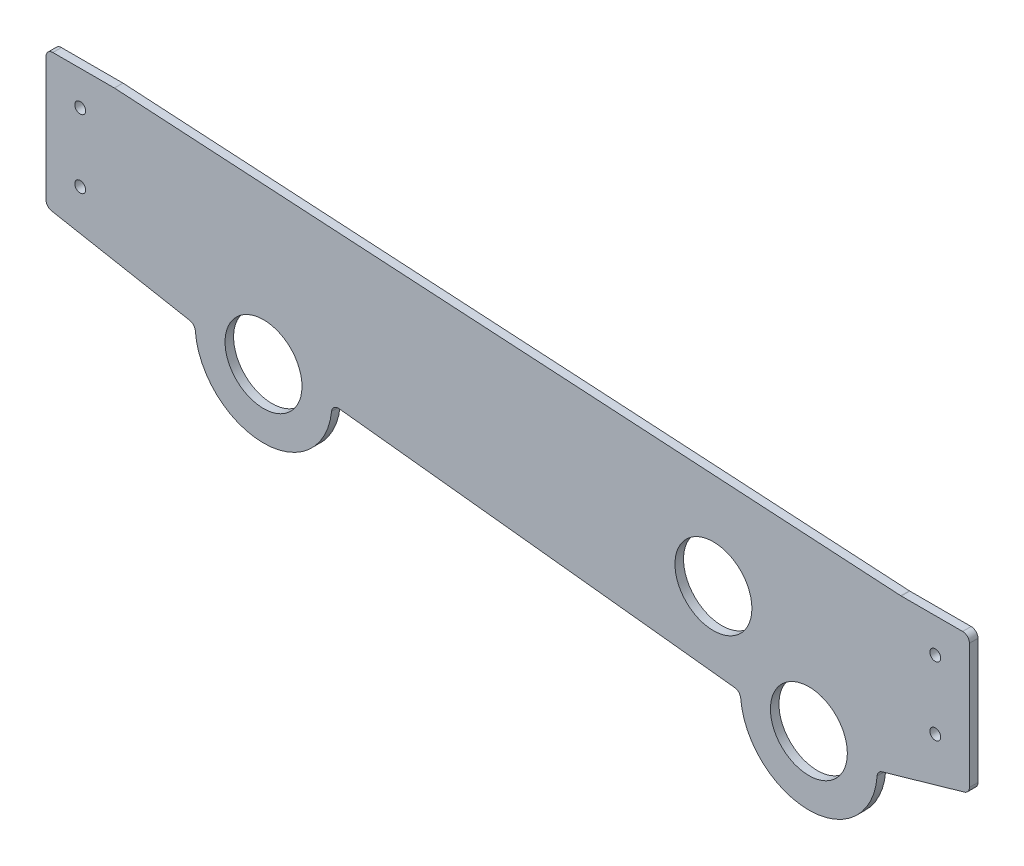
ISO-10303-21;
HEADER;
FILE_DESCRIPTION(('STEP AP214'),'2;1');
FILE_NAME('part.step','',(''),(''),'','','');
FILE_SCHEMA(('AUTOMOTIVE_DESIGN { 1 0 10303 214 1 1 1 1 }'));
ENDSEC;
DATA;
#1=APPLICATION_CONTEXT('core data for automotive mechanical design processes');
#2=APPLICATION_PROTOCOL_DEFINITION('international standard','automotive_design',2000,#1);
#3=PRODUCT_CONTEXT('',#1,'mechanical');
#4=PRODUCT('Part','Part','',(#3));
#5=PRODUCT_RELATED_PRODUCT_CATEGORY('part','',(#4));
#6=PRODUCT_DEFINITION_FORMATION('','',#4);
#7=PRODUCT_DEFINITION_CONTEXT('part definition',#1,'design');
#8=PRODUCT_DEFINITION('design','',#6,#7);
#9=PRODUCT_DEFINITION_SHAPE('','',#8);
#10=(LENGTH_UNIT() NAMED_UNIT(*) SI_UNIT(.MILLI.,.METRE.));
#11=(NAMED_UNIT(*) PLANE_ANGLE_UNIT() SI_UNIT($,.RADIAN.));
#12=(NAMED_UNIT(*) SI_UNIT($,.STERADIAN.) SOLID_ANGLE_UNIT());
#13=UNCERTAINTY_MEASURE_WITH_UNIT(LENGTH_MEASURE(1.E-05),#10,'distance_accuracy_value','');
#14=(GEOMETRIC_REPRESENTATION_CONTEXT(3) GLOBAL_UNCERTAINTY_ASSIGNED_CONTEXT((#13)) GLOBAL_UNIT_ASSIGNED_CONTEXT((#10,
#11,#12)) REPRESENTATION_CONTEXT('',''));
#15=CARTESIAN_POINT('',(0.,0.,0.));
#16=DIRECTION('',(0.,0.,1.));
#17=DIRECTION('',(1.,0.,0.));
#18=AXIS2_PLACEMENT_3D('',#15,#16,#17);
#19=CARTESIAN_POINT('',(10.4781248121463,94.7543025822281,3.175));
#20=DIRECTION('',(0.109912065955774,0.993941315046987,0.));
#21=DIRECTION('',(-0.993941315046987,0.109912065955774,0.));
#22=AXIS2_PLACEMENT_3D('',#19,#20,#21);
#23=PLANE('',#22);
#24=DIRECTION('',(0.993941315046987,-0.109912065955774,0.));
#25=VECTOR('',#24,1.);
#26=CARTESIAN_POINT('',(10.4781248121463,94.7543025822281,0.));
#27=LINE('',#26,#25);
#28=CARTESIAN_POINT('',(-62.6049750387486,102.835981419257,0.));
#29=VERTEX_POINT('',#28);
#30=CARTESIAN_POINT('',(84.2576603035122,86.5956104659536,0.));
#31=VERTEX_POINT('',#30);
#32=EDGE_CURVE('E245',#29,#31,#27,.T.);
#33=ORIENTED_EDGE('',*,*,#32,.T.);
#34=DIRECTION('',(0.,0.,1.));
#35=VECTOR('',#34,1.);
#36=CARTESIAN_POINT('',(84.2576603035122,86.5956104659536,3.175));
#37=LINE('',#36,#35);
#38=CARTESIAN_POINT('',(84.2576603035122,86.5956104659536,3.175));
#39=VERTEX_POINT('',#38);
#40=EDGE_CURVE('E356',#31,#39,#37,.T.);
#41=ORIENTED_EDGE('',*,*,#40,.T.);
#42=DIRECTION('',(0.993941315046987,-0.109912065955774,0.));
#43=VECTOR('',#42,1.);
#44=CARTESIAN_POINT('',(10.4781248121463,94.7543025822281,3.175));
#45=LINE('',#44,#43);
#46=CARTESIAN_POINT('',(-62.6049750387486,102.835981419257,3.175));
#47=VERTEX_POINT('',#46);
#48=EDGE_CURVE('E409',#47,#39,#45,.T.);
#49=ORIENTED_EDGE('',*,*,#48,.F.);
#50=DIRECTION('',(0.,0.,1.));
#51=VECTOR('',#50,1.);
#52=CARTESIAN_POINT('',(-62.6049750387486,102.835981419257,0.));
#53=LINE('',#52,#51);
#54=EDGE_CURVE('E352',#47,#29,#53,.F.);
#55=ORIENTED_EDGE('',*,*,#54,.T.);
#56=EDGE_LOOP('',(#33,#41,#49,#55));
#57=FACE_BOUND('',#56,.T.);
#58=ADVANCED_FACE('F42',(#57),#23,.F.);
#59=CARTESIAN_POINT('',(111.824894309563,86.3559532916229,3.175));
#60=DIRECTION('',(0.,0.,-1.));
#61=DIRECTION('',(-1.,0.,0.));
#62=AXIS2_PLACEMENT_3D('',#59,#60,#61);
#63=CYLINDRICAL_SURFACE('',#62,25.4);
#64=CARTESIAN_POINT('',(111.824894309563,86.3559532916229,3.175));
#65=DIRECTION('',(0.,0.,1.));
#66=DIRECTION('',(1.,0.,0.));
#67=AXIS2_PLACEMENT_3D('',#64,#65,#66);
#68=CIRCLE('',#67,25.4);
#69=CARTESIAN_POINT('',(86.5099755335826,84.2787225953605,3.175));
#70=VERTEX_POINT('',#69);
#71=CARTESIAN_POINT('',(137.164009765819,84.5983333399428,3.175));
#72=VERTEX_POINT('',#71);
#73=EDGE_CURVE('E420',#70,#72,#68,.T.);
#74=ORIENTED_EDGE('',*,*,#73,.F.);
#75=DIRECTION('',(0.,0.,-1.));
#76=VECTOR('',#75,1.);
#77=CARTESIAN_POINT('',(86.5099755335826,84.2787225953605,3.175));
#78=LINE('',#77,#76);
#79=CARTESIAN_POINT('',(86.5099755335826,84.2787225953605,0.));
#80=VERTEX_POINT('',#79);
#81=EDGE_CURVE('E348',#70,#80,#78,.T.);
#82=ORIENTED_EDGE('',*,*,#81,.T.);
#83=CARTESIAN_POINT('',(111.824894309563,86.3559532916229,0.));
#84=DIRECTION('',(0.,0.,1.));
#85=DIRECTION('',(1.,0.,0.));
#86=AXIS2_PLACEMENT_3D('',#83,#84,#85);
#87=CIRCLE('',#86,25.4);
#88=CARTESIAN_POINT('',(137.164009765819,84.5983333399428,0.));
#89=VERTEX_POINT('',#88);
#90=EDGE_CURVE('E249',#80,#89,#87,.T.);
#91=ORIENTED_EDGE('',*,*,#90,.T.);
#92=DIRECTION('',(0.,0.,-1.));
#93=VECTOR('',#92,1.);
#94=CARTESIAN_POINT('',(137.164009765819,84.5983333399428,3.175));
#95=LINE('',#94,#93);
#96=EDGE_CURVE('E345',#89,#72,#95,.F.);
#97=ORIENTED_EDGE('',*,*,#96,.T.);
#98=EDGE_LOOP('',(#74,#82,#91,#97));
#99=FACE_BOUND('',#98,.T.);
#100=ADVANCED_FACE('F417',(#99),#63,.T.);
#101=CARTESIAN_POINT('',(-12.4550081915659,43.4486341080888,3.175));
#102=DIRECTION('',(-0.27556197601449,0.961283307550375,0.));
#103=DIRECTION('',(-0.961283307550375,-0.27556197601449,0.));
#104=AXIS2_PLACEMENT_3D('',#101,#102,#103);
#105=PLANE('',#104);
#106=DIRECTION('',(0.961283307550375,0.27556197601449,0.));
#107=VECTOR('',#106,1.);
#108=CARTESIAN_POINT('',(-12.4550081915659,43.4486341080888,0.));
#109=LINE('',#108,#107);
#110=CARTESIAN_POINT('',(138.997993892368,86.8642309459527,0.));
#111=VERTEX_POINT('',#110);
#112=CARTESIAN_POINT('',(169.609927419077,95.6394638309803,0.));
#113=VERTEX_POINT('',#112);
#114=EDGE_CURVE('E253',#111,#113,#109,.T.);
#115=ORIENTED_EDGE('',*,*,#114,.T.);
#116=DIRECTION('',(0.,0.,-1.));
#117=VECTOR('',#116,1.);
#118=CARTESIAN_POINT('',(169.609927419077,95.6394638309803,3.175));
#119=LINE('',#118,#117);
#120=CARTESIAN_POINT('',(169.609927419077,95.6394638309803,3.175));
#121=VERTEX_POINT('',#120);
#122=EDGE_CURVE('E332',#113,#121,#119,.F.);
#123=ORIENTED_EDGE('',*,*,#122,.T.);
#124=DIRECTION('',(0.961283307550375,0.27556197601449,0.));
#125=VECTOR('',#124,1.);
#126=CARTESIAN_POINT('',(-12.4550081915659,43.4486341080888,3.175));
#127=LINE('',#126,#125);
#128=CARTESIAN_POINT('',(138.997993892368,86.8642309459527,3.175));
#129=VERTEX_POINT('',#128);
#130=EDGE_CURVE('E423',#129,#121,#127,.T.);
#131=ORIENTED_EDGE('',*,*,#130,.F.);
#132=DIRECTION('',(0.,0.,1.));
#133=VECTOR('',#132,1.);
#134=CARTESIAN_POINT('',(138.997993892368,86.8642309459527,0.));
#135=LINE('',#134,#133);
#136=EDGE_CURVE('E328',#129,#111,#135,.F.);
#137=ORIENTED_EDGE('',*,*,#136,.T.);
#138=EDGE_LOOP('',(#115,#123,#131,#137));
#139=FACE_BOUND('',#138,.T.);
#140=ADVANCED_FACE('F467',(#139),#105,.F.);
#141=CARTESIAN_POINT('',(171.45,0.,3.175));
#142=DIRECTION('',(-1.,0.,0.));
#143=DIRECTION('',(0.,0.,1.));
#144=AXIS2_PLACEMENT_3D('',#141,#142,#143);
#145=PLANE('',#144);
#146=DIRECTION('',(0.,1.,0.));
#147=VECTOR('',#146,1.);
#148=CARTESIAN_POINT('',(171.45,0.,0.));
#149=LINE('',#148,#147);
#150=CARTESIAN_POINT('',(171.45,98.0811234321583,0.));
#151=VERTEX_POINT('',#150);
#152=CARTESIAN_POINT('',(171.45,144.42694,0.));
#153=VERTEX_POINT('',#152);
#154=EDGE_CURVE('E257',#151,#153,#149,.T.);
#155=ORIENTED_EDGE('',*,*,#154,.T.);
#156=DIRECTION('',(0.,0.,-1.));
#157=VECTOR('',#156,1.);
#158=CARTESIAN_POINT('',(171.45,144.42694,3.175));
#159=LINE('',#158,#157);
#160=CARTESIAN_POINT('',(171.45,144.42694,3.175));
#161=VERTEX_POINT('',#160);
#162=EDGE_CURVE('E325',#153,#161,#159,.F.);
#163=ORIENTED_EDGE('',*,*,#162,.T.);
#164=DIRECTION('',(0.,1.,0.));
#165=VECTOR('',#164,1.);
#166=CARTESIAN_POINT('',(171.45,0.,3.175));
#167=LINE('',#166,#165);
#168=CARTESIAN_POINT('',(171.45,98.0811234321583,3.175));
#169=VERTEX_POINT('',#168);
#170=EDGE_CURVE('E208',#169,#161,#167,.T.);
#171=ORIENTED_EDGE('',*,*,#170,.F.);
#172=DIRECTION('',(0.,0.,-1.));
#173=VECTOR('',#172,1.);
#174=CARTESIAN_POINT('',(171.45,98.0811234321583,3.175));
#175=LINE('',#174,#173);
#176=EDGE_CURVE('E321',#169,#151,#175,.T.);
#177=ORIENTED_EDGE('',*,*,#176,.T.);
#178=EDGE_LOOP('',(#155,#163,#171,#177));
#179=FACE_BOUND('',#178,.T.);
#180=ADVANCED_FACE('F506',(#179),#145,.F.);
#181=CARTESIAN_POINT('',(0.,146.96694,3.175));
#182=DIRECTION('',(0.,1.,0.));
#183=DIRECTION('',(0.,0.,1.));
#184=AXIS2_PLACEMENT_3D('',#181,#182,#183);
#185=PLANE('',#184);
#186=DIRECTION('',(1.,0.,0.));
#187=VECTOR('',#186,1.);
#188=CARTESIAN_POINT('',(0.,146.96694,3.175));
#189=LINE('',#188,#187);
#190=CARTESIAN_POINT('',(146.125030125413,146.96694,3.175));
#191=VERTEX_POINT('',#190);
#192=CARTESIAN_POINT('',(168.91,146.96694,3.175));
#193=VERTEX_POINT('',#192);
#194=EDGE_CURVE('E204',#191,#193,#189,.T.);
#195=ORIENTED_EDGE('',*,*,#194,.T.);
#196=DIRECTION('',(0.,0.,-1.));
#197=VECTOR('',#196,1.);
#198=CARTESIAN_POINT('',(168.91,146.96694,0.));
#199=LINE('',#198,#197);
#200=CARTESIAN_POINT('',(168.91,146.96694,0.));
#201=VERTEX_POINT('',#200);
#202=EDGE_CURVE('E317',#193,#201,#199,.T.);
#203=ORIENTED_EDGE('',*,*,#202,.T.);
#204=DIRECTION('',(1.,0.,0.));
#205=VECTOR('',#204,1.);
#206=CARTESIAN_POINT('',(0.,146.96694,0.));
#207=LINE('',#206,#205);
#208=CARTESIAN_POINT('',(146.125030125413,146.96694,0.));
#209=VERTEX_POINT('',#208);
#210=EDGE_CURVE('E261',#209,#201,#207,.T.);
#211=ORIENTED_EDGE('',*,*,#210,.F.);
#212=DIRECTION('',(0.,0.,-1.));
#213=VECTOR('',#212,1.);
#214=CARTESIAN_POINT('',(146.125030125413,146.96694,3.175));
#215=LINE('',#214,#213);
#216=EDGE_CURVE('E314',#209,#191,#215,.F.);
#217=ORIENTED_EDGE('',*,*,#216,.T.);
#218=EDGE_LOOP('',(#195,#203,#211,#217));
#219=FACE_BOUND('',#218,.T.);
#220=ADVANCED_FACE('F445',(#219),#185,.T.);
#221=CARTESIAN_POINT('',(9.16881158655861,155.060784184447,3.175));
#222=DIRECTION('',(0.0590273329964298,0.998256366851386,0.));
#223=DIRECTION('',(-0.998256366851386,0.0590273329964298,0.));
#224=AXIS2_PLACEMENT_3D('',#221,#222,#223);
#225=PLANE('',#224);
#226=DIRECTION('',(0.998256366851386,-0.0590273329964298,0.));
#227=VECTOR('',#226,1.);
#228=CARTESIAN_POINT('',(9.16881158655861,155.060784184447,3.175));
#229=LINE('',#228,#227);
#230=CARTESIAN_POINT('',(-146.05,164.23894,3.175));
#231=VERTEX_POINT('',#230);
#232=CARTESIAN_POINT('',(145.975100699602,146.971368828197,3.175));
#233=VERTEX_POINT('',#232);
#234=EDGE_CURVE('E179',#231,#233,#229,.T.);
#235=ORIENTED_EDGE('',*,*,#234,.T.);
#236=DIRECTION('',(0.,0.,-1.));
#237=VECTOR('',#236,1.);
#238=CARTESIAN_POINT('',(145.975100699602,146.971368828197,0.));
#239=LINE('',#238,#237);
#240=CARTESIAN_POINT('',(145.975100699602,146.971368828197,0.));
#241=VERTEX_POINT('',#240);
#242=EDGE_CURVE('E342',#233,#241,#239,.T.);
#243=ORIENTED_EDGE('',*,*,#242,.T.);
#244=DIRECTION('',(0.998256366851386,-0.0590273329964298,0.));
#245=VECTOR('',#244,1.);
#246=CARTESIAN_POINT('',(9.16881158655861,155.060784184447,0.));
#247=LINE('',#246,#245);
#248=CARTESIAN_POINT('',(-146.05,164.23894,0.));
#249=VERTEX_POINT('',#248);
#250=EDGE_CURVE('E182',#249,#241,#247,.T.);
#251=ORIENTED_EDGE('',*,*,#250,.F.);
#252=DIRECTION('',(0.,0.,-1.));
#253=VECTOR('',#252,1.);
#254=CARTESIAN_POINT('',(-146.05,164.23894,3.175));
#255=LINE('',#254,#253);
#256=EDGE_CURVE('E174',#231,#249,#255,.T.);
#257=ORIENTED_EDGE('',*,*,#256,.F.);
#258=EDGE_LOOP('',(#235,#243,#251,#257));
#259=FACE_BOUND('',#258,.T.);
#260=ADVANCED_FACE('F176',(#259),#225,.T.);
#261=CARTESIAN_POINT('',(0.,164.23894,3.175));
#262=DIRECTION('',(0.,-1.,0.));
#263=DIRECTION('',(0.,0.,-1.));
#264=AXIS2_PLACEMENT_3D('',#261,#262,#263);
#265=PLANE('',#264);
#266=DIRECTION('',(-1.,0.,0.));
#267=VECTOR('',#266,1.);
#268=CARTESIAN_POINT('',(0.,164.23894,0.));
#269=LINE('',#268,#267);
#270=CARTESIAN_POINT('',(-168.91,164.23894,0.));
#271=VERTEX_POINT('',#270);
#272=EDGE_CURVE('E267',#249,#271,#269,.T.);
#273=ORIENTED_EDGE('',*,*,#272,.T.);
#274=DIRECTION('',(0.,0.,-1.));
#275=VECTOR('',#274,1.);
#276=CARTESIAN_POINT('',(-168.91,164.23894,3.175));
#277=LINE('',#276,#275);
#278=CARTESIAN_POINT('',(-168.91,164.23894,3.175));
#279=VERTEX_POINT('',#278);
#280=EDGE_CURVE('E194',#271,#279,#277,.F.);
#281=ORIENTED_EDGE('',*,*,#280,.T.);
#282=DIRECTION('',(-1.,0.,0.));
#283=VECTOR('',#282,1.);
#284=CARTESIAN_POINT('',(0.,164.23894,3.175));
#285=LINE('',#284,#283);
#286=EDGE_CURVE('E191',#231,#279,#285,.T.);
#287=ORIENTED_EDGE('',*,*,#286,.F.);
#288=ORIENTED_EDGE('',*,*,#256,.T.);
#289=EDGE_LOOP('',(#273,#281,#287,#288));
#290=FACE_BOUND('',#289,.T.);
#291=ADVANCED_FACE('F192',(#290),#265,.F.);
#292=CARTESIAN_POINT('',(-171.45,0.,3.175));
#293=DIRECTION('',(-1.,0.,0.));
#294=DIRECTION('',(0.,0.,1.));
#295=AXIS2_PLACEMENT_3D('',#292,#293,#294);
#296=PLANE('',#295);
#297=DIRECTION('',(0.,1.,0.));
#298=VECTOR('',#297,1.);
#299=CARTESIAN_POINT('',(-171.45,0.,3.175));
#300=LINE('',#299,#298);
#301=CARTESIAN_POINT('',(-171.45,115.549747155126,3.175));
#302=VERTEX_POINT('',#301);
#303=CARTESIAN_POINT('',(-171.45,161.69894,3.175));
#304=VERTEX_POINT('',#303);
#305=EDGE_CURVE('E197',#302,#304,#300,.T.);
#306=ORIENTED_EDGE('',*,*,#305,.T.);
#307=DIRECTION('',(0.,0.,-1.));
#308=VECTOR('',#307,1.);
#309=CARTESIAN_POINT('',(-171.45,161.69894,0.));
#310=LINE('',#309,#308);
#311=CARTESIAN_POINT('',(-171.45,161.69894,0.));
#312=VERTEX_POINT('',#311);
#313=EDGE_CURVE('E284',#304,#312,#310,.T.);
#314=ORIENTED_EDGE('',*,*,#313,.T.);
#315=DIRECTION('',(0.,1.,0.));
#316=VECTOR('',#315,1.);
#317=CARTESIAN_POINT('',(-171.45,0.,0.));
#318=LINE('',#317,#316);
#319=CARTESIAN_POINT('',(-171.45,115.549747155126,0.));
#320=VERTEX_POINT('',#319);
#321=EDGE_CURVE('E270',#320,#312,#318,.T.);
#322=ORIENTED_EDGE('',*,*,#321,.F.);
#323=DIRECTION('',(0.,0.,-1.));
#324=VECTOR('',#323,1.);
#325=CARTESIAN_POINT('',(-171.45,115.549747155126,3.175));
#326=LINE('',#325,#324);
#327=EDGE_CURVE('E187',#320,#302,#326,.F.);
#328=ORIENTED_EDGE('',*,*,#327,.T.);
#329=EDGE_LOOP('',(#306,#314,#322,#328));
#330=FACE_BOUND('',#329,.T.);
#331=ADVANCED_FACE('F541',(#330),#296,.T.);
#332=CARTESIAN_POINT('',(14.6674536846778,78.7927376613752,3.175));
#333=DIRECTION('',(0.183008489971372,0.983111332758604,0.));
#334=DIRECTION('',(-0.983111332758604,0.183008489971372,0.));
#335=AXIS2_PLACEMENT_3D('',#332,#333,#334);
#336=PLANE('',#335);
#337=DIRECTION('',(0.983111332758604,-0.183008489971372,0.));
#338=VECTOR('',#337,1.);
#339=CARTESIAN_POINT('',(14.6674536846778,78.7927376613752,3.175));
#340=LINE('',#339,#338);
#341=CARTESIAN_POINT('',(-169.374841564527,113.05264436992,3.175));
#342=VERTEX_POINT('',#341);
#343=CARTESIAN_POINT('',(-118.075581162747,103.503166228482,3.175));
#344=VERTEX_POINT('',#343);
#345=EDGE_CURVE('E215',#342,#344,#340,.T.);
#346=ORIENTED_EDGE('',*,*,#345,.F.);
#347=DIRECTION('',(0.,0.,-1.));
#348=VECTOR('',#347,1.);
#349=CARTESIAN_POINT('',(-169.374841564527,113.05264436992,0.));
#350=LINE('',#349,#348);
#351=CARTESIAN_POINT('',(-169.374841564527,113.05264436992,0.));
#352=VERTEX_POINT('',#351);
#353=EDGE_CURVE('E338',#342,#352,#350,.T.);
#354=ORIENTED_EDGE('',*,*,#353,.T.);
#355=DIRECTION('',(0.983111332758604,-0.183008489971372,0.));
#356=VECTOR('',#355,1.);
#357=CARTESIAN_POINT('',(14.6674536846778,78.7927376613752,0.));
#358=LINE('',#357,#356);
#359=CARTESIAN_POINT('',(-118.075581162747,103.503166228482,0.));
#360=VERTEX_POINT('',#359);
#361=EDGE_CURVE('E274',#352,#360,#358,.T.);
#362=ORIENTED_EDGE('',*,*,#361,.T.);
#363=DIRECTION('',(0.,0.,1.));
#364=VECTOR('',#363,1.);
#365=CARTESIAN_POINT('',(-118.075581162747,103.503166228482,3.175));
#366=LINE('',#365,#364);
#367=EDGE_CURVE('E335',#360,#344,#366,.T.);
#368=ORIENTED_EDGE('',*,*,#367,.T.);
#369=EDGE_LOOP('',(#346,#354,#362,#368));
#370=FACE_BOUND('',#369,.T.);
#371=ADVANCED_FACE('F397',(#370),#336,.F.);
#372=CARTESIAN_POINT('',(-158.75,126.13894,3.175));
#373=DIRECTION('',(0.,0.,-1.));
#374=DIRECTION('',(-1.,0.,0.));
#375=AXIS2_PLACEMENT_3D('',#372,#373,#374);
#376=CYLINDRICAL_SURFACE('',#375,2.0193);
#377=CARTESIAN_POINT('',(-158.75,126.13894,3.175));
#378=DIRECTION('',(0.,0.,1.));
#379=DIRECTION('',(1.,0.,0.));
#380=AXIS2_PLACEMENT_3D('',#377,#378,#379);
#381=CIRCLE('',#380,2.0193);
#382=CARTESIAN_POINT('',(-156.7307,126.13894,3.175));
#383=VERTEX_POINT('',#382);
#384=EDGE_CURVE('E429',#383,#383,#381,.T.);
#385=ORIENTED_EDGE('',*,*,#384,.T.);
#386=EDGE_LOOP('',(#385));
#387=FACE_BOUND('',#386,.T.);
#388=CARTESIAN_POINT('',(-158.75,126.13894,0.));
#389=DIRECTION('',(0.,0.,1.));
#390=DIRECTION('',(1.,0.,0.));
#391=AXIS2_PLACEMENT_3D('',#388,#389,#390);
#392=CIRCLE('',#391,2.0193);
#393=CARTESIAN_POINT('',(-156.7307,126.13894,0.));
#394=VERTEX_POINT('',#393);
#395=EDGE_CURVE('E241',#394,#394,#392,.T.);
#396=ORIENTED_EDGE('',*,*,#395,.F.);
#397=EDGE_LOOP('',(#396));
#398=FACE_BOUND('',#397,.T.);
#399=ADVANCED_FACE('F471',(#387,#398),#376,.F.);
#400=CARTESIAN_POINT('',(158.75,108.86694,3.175));
#401=DIRECTION('',(0.,0.,-1.));
#402=DIRECTION('',(-1.,0.,0.));
#403=AXIS2_PLACEMENT_3D('',#400,#401,#402);
#404=CYLINDRICAL_SURFACE('',#403,2.01930000000001);
#405=CARTESIAN_POINT('',(158.75,108.86694,3.175));
#406=DIRECTION('',(0.,0.,1.));
#407=DIRECTION('',(1.,0.,0.));
#408=AXIS2_PLACEMENT_3D('',#405,#406,#407);
#409=CIRCLE('',#408,2.01930000000001);
#410=CARTESIAN_POINT('',(160.7693,108.86694,3.175));
#411=VERTEX_POINT('',#410);
#412=EDGE_CURVE('E756',#411,#411,#409,.T.);
#413=ORIENTED_EDGE('',*,*,#412,.T.);
#414=EDGE_LOOP('',(#413));
#415=FACE_BOUND('',#414,.T.);
#416=CARTESIAN_POINT('',(158.75,108.86694,0.));
#417=DIRECTION('',(0.,0.,1.));
#418=DIRECTION('',(1.,0.,0.));
#419=AXIS2_PLACEMENT_3D('',#416,#417,#418);
#420=CIRCLE('',#419,2.01930000000001);
#421=CARTESIAN_POINT('',(160.7693,108.86694,0.));
#422=VERTEX_POINT('',#421);
#423=EDGE_CURVE('E237',#422,#422,#420,.T.);
#424=ORIENTED_EDGE('',*,*,#423,.F.);
#425=EDGE_LOOP('',(#424));
#426=FACE_BOUND('',#425,.T.);
#427=ADVANCED_FACE('F474',(#415,#426),#404,.F.);
#428=CARTESIAN_POINT('',(158.75,134.26694,3.175));
#429=DIRECTION('',(0.,0.,-1.));
#430=DIRECTION('',(-1.,0.,0.));
#431=AXIS2_PLACEMENT_3D('',#428,#429,#430);
#432=CYLINDRICAL_SURFACE('',#431,2.0193);
#433=CARTESIAN_POINT('',(158.75,134.26694,3.175));
#434=DIRECTION('',(0.,0.,1.));
#435=DIRECTION('',(1.,0.,0.));
#436=AXIS2_PLACEMENT_3D('',#433,#434,#435);
#437=CIRCLE('',#436,2.0193);
#438=CARTESIAN_POINT('',(160.7693,134.26694,3.175));
#439=VERTEX_POINT('',#438);
#440=EDGE_CURVE('E752',#439,#439,#437,.T.);
#441=ORIENTED_EDGE('',*,*,#440,.T.);
#442=EDGE_LOOP('',(#441));
#443=FACE_BOUND('',#442,.T.);
#444=CARTESIAN_POINT('',(158.75,134.26694,0.));
#445=DIRECTION('',(0.,0.,1.));
#446=DIRECTION('',(1.,0.,0.));
#447=AXIS2_PLACEMENT_3D('',#444,#445,#446);
#448=CIRCLE('',#447,2.0193);
#449=CARTESIAN_POINT('',(160.7693,134.26694,0.));
#450=VERTEX_POINT('',#449);
#451=EDGE_CURVE('E233',#450,#450,#448,.T.);
#452=ORIENTED_EDGE('',*,*,#451,.F.);
#453=EDGE_LOOP('',(#452));
#454=FACE_BOUND('',#453,.T.);
#455=ADVANCED_FACE('F478',(#443,#454),#432,.F.);
#456=CARTESIAN_POINT('',(-158.75,151.53894,3.175));
#457=DIRECTION('',(0.,0.,-1.));
#458=DIRECTION('',(-1.,0.,0.));
#459=AXIS2_PLACEMENT_3D('',#456,#457,#458);
#460=CYLINDRICAL_SURFACE('',#459,2.0193);
#461=CARTESIAN_POINT('',(-158.75,151.53894,3.175));
#462=DIRECTION('',(0.,0.,1.));
#463=DIRECTION('',(1.,0.,0.));
#464=AXIS2_PLACEMENT_3D('',#461,#462,#463);
#465=CIRCLE('',#464,2.0193);
#466=CARTESIAN_POINT('',(-156.7307,151.53894,3.175));
#467=VERTEX_POINT('',#466);
#468=EDGE_CURVE('E748',#467,#467,#465,.T.);
#469=ORIENTED_EDGE('',*,*,#468,.T.);
#470=EDGE_LOOP('',(#469));
#471=FACE_BOUND('',#470,.T.);
#472=CARTESIAN_POINT('',(-158.75,151.53894,0.));
#473=DIRECTION('',(0.,0.,1.));
#474=DIRECTION('',(1.,0.,0.));
#475=AXIS2_PLACEMENT_3D('',#472,#473,#474);
#476=CIRCLE('',#475,2.0193);
#477=CARTESIAN_POINT('',(-156.7307,151.53894,0.));
#478=VERTEX_POINT('',#477);
#479=EDGE_CURVE('E229',#478,#478,#476,.T.);
#480=ORIENTED_EDGE('',*,*,#479,.F.);
#481=EDGE_LOOP('',(#480));
#482=FACE_BOUND('',#481,.T.);
#483=ADVANCED_FACE('F482',(#471,#482),#460,.F.);
#484=CARTESIAN_POINT('',(111.824894309563,86.3559532916229,3.175));
#485=DIRECTION('',(0.,0.,-1.));
#486=DIRECTION('',(-1.,0.,0.));
#487=AXIS2_PLACEMENT_3D('',#484,#485,#486);
#488=CYLINDRICAL_SURFACE('',#487,14.2875);
#489=CARTESIAN_POINT('',(111.824894309563,86.3559532916229,3.175));
#490=DIRECTION('',(0.,0.,1.));
#491=DIRECTION('',(1.,0.,0.));
#492=AXIS2_PLACEMENT_3D('',#489,#490,#491);
#493=CIRCLE('',#492,14.2875);
#494=CARTESIAN_POINT('',(126.112394309563,86.3559532916229,3.175));
#495=VERTEX_POINT('',#494);
#496=EDGE_CURVE('E744',#495,#495,#493,.T.);
#497=ORIENTED_EDGE('',*,*,#496,.T.);
#498=EDGE_LOOP('',(#497));
#499=FACE_BOUND('',#498,.T.);
#500=CARTESIAN_POINT('',(111.824894309563,86.3559532916229,0.));
#501=DIRECTION('',(0.,0.,1.));
#502=DIRECTION('',(1.,0.,0.));
#503=AXIS2_PLACEMENT_3D('',#500,#501,#502);
#504=CIRCLE('',#503,14.2875);
#505=CARTESIAN_POINT('',(126.112394309563,86.3559532916229,0.));
#506=VERTEX_POINT('',#505);
#507=EDGE_CURVE('E224',#506,#506,#504,.T.);
#508=ORIENTED_EDGE('',*,*,#507,.F.);
#509=EDGE_LOOP('',(#508));
#510=FACE_BOUND('',#509,.T.);
#511=ADVANCED_FACE('F486',(#499,#510),#488,.F.);
#512=CARTESIAN_POINT('',(-90.681416721827,103.131947821241,3.175));
#513=DIRECTION('',(0.,0.,-1.));
#514=DIRECTION('',(-1.,0.,0.));
#515=AXIS2_PLACEMENT_3D('',#512,#513,#514);
#516=CYLINDRICAL_SURFACE('',#515,14.2875);
#517=CARTESIAN_POINT('',(-90.681416721827,103.131947821241,3.175));
#518=DIRECTION('',(0.,0.,1.));
#519=DIRECTION('',(1.,0.,0.));
#520=AXIS2_PLACEMENT_3D('',#517,#518,#519);
#521=CIRCLE('',#520,14.2875);
#522=CARTESIAN_POINT('',(-76.393916721827,103.131947821241,3.175));
#523=VERTEX_POINT('',#522);
#524=EDGE_CURVE('E280',#523,#523,#521,.T.);
#525=ORIENTED_EDGE('',*,*,#524,.T.);
#526=EDGE_LOOP('',(#525));
#527=FACE_BOUND('',#526,.T.);
#528=CARTESIAN_POINT('',(-90.681416721827,103.131947821241,0.));
#529=DIRECTION('',(0.,0.,1.));
#530=DIRECTION('',(1.,0.,0.));
#531=AXIS2_PLACEMENT_3D('',#528,#529,#530);
#532=CIRCLE('',#531,14.2875);
#533=CARTESIAN_POINT('',(-76.393916721827,103.131947821241,0.));
#534=VERTEX_POINT('',#533);
#535=EDGE_CURVE('E220',#534,#534,#532,.T.);
#536=ORIENTED_EDGE('',*,*,#535,.F.);
#537=EDGE_LOOP('',(#536));
#538=FACE_BOUND('',#537,.T.);
#539=ADVANCED_FACE('F490',(#527,#538),#516,.F.);
#540=CARTESIAN_POINT('',(-90.681416721827,103.131947821241,3.175));
#541=DIRECTION('',(0.,0.,-1.));
#542=DIRECTION('',(-1.,0.,0.));
#543=AXIS2_PLACEMENT_3D('',#540,#541,#542);
#544=CYLINDRICAL_SURFACE('',#543,25.4);
#545=CARTESIAN_POINT('',(-90.681416721827,103.131947821241,0.));
#546=DIRECTION('',(0.,0.,1.));
#547=DIRECTION('',(1.,0.,0.));
#548=AXIS2_PLACEMENT_3D('',#545,#546,#547);
#549=CIRCLE('',#548,25.4);
#550=CARTESIAN_POINT('',(-116.007785817688,101.199325659454,0.));
#551=VERTEX_POINT('',#550);
#552=CARTESIAN_POINT('',(-65.4111757804173,100.567786601056,0.));
#553=VERTEX_POINT('',#552);
#554=EDGE_CURVE('E278',#551,#553,#549,.T.);
#555=ORIENTED_EDGE('',*,*,#554,.T.);
#556=DIRECTION('',(0.,0.,-1.));
#557=VECTOR('',#556,1.);
#558=CARTESIAN_POINT('',(-65.4111757804173,100.567786601056,3.175));
#559=LINE('',#558,#557);
#560=CARTESIAN_POINT('',(-65.4111757804173,100.567786601056,3.175));
#561=VERTEX_POINT('',#560);
#562=EDGE_CURVE('E58',#553,#561,#559,.F.);
#563=ORIENTED_EDGE('',*,*,#562,.T.);
#564=CARTESIAN_POINT('',(-90.681416721827,103.131947821241,3.175));
#565=DIRECTION('',(0.,0.,1.));
#566=DIRECTION('',(1.,0.,0.));
#567=AXIS2_PLACEMENT_3D('',#564,#565,#566);
#568=CIRCLE('',#567,25.4);
#569=CARTESIAN_POINT('',(-116.007785817688,101.199325659454,3.175));
#570=VERTEX_POINT('',#569);
#571=EDGE_CURVE('E188',#570,#561,#568,.T.);
#572=ORIENTED_EDGE('',*,*,#571,.F.);
#573=DIRECTION('',(0.,0.,-1.));
#574=VECTOR('',#573,1.);
#575=CARTESIAN_POINT('',(-116.007785817688,101.199325659454,3.175));
#576=LINE('',#575,#574);
#577=EDGE_CURVE('E359',#570,#551,#576,.T.);
#578=ORIENTED_EDGE('',*,*,#577,.T.);
#579=EDGE_LOOP('',(#555,#563,#572,#578));
#580=FACE_BOUND('',#579,.T.);
#581=ADVANCED_FACE('F399',(#580),#544,.T.);
#582=CARTESIAN_POINT('',(0.,0.,3.175));
#583=DIRECTION('',(0.,0.,1.));
#584=DIRECTION('',(1.,0.,0.));
#585=AXIS2_PLACEMENT_3D('',#582,#583,#584);
#586=PLANE('',#585);
#587=CARTESIAN_POINT('',(76.3807096061349,115.235499179833,3.175));
#588=DIRECTION('',(0.,0.,1.));
#589=DIRECTION('',(1.,0.,0.));
#590=AXIS2_PLACEMENT_3D('',#587,#588,#589);
#591=CIRCLE('',#590,14.2875);
#592=CARTESIAN_POINT('',(90.6682096061349,115.235499179833,3.175));
#593=VERTEX_POINT('',#592);
#594=EDGE_CURVE('E735',#593,#593,#591,.T.);
#595=ORIENTED_EDGE('',*,*,#594,.F.);
#596=EDGE_LOOP('',(#595));
#597=FACE_BOUND('',#596,.T.);
#598=ORIENTED_EDGE('',*,*,#524,.F.);
#599=EDGE_LOOP('',(#598));
#600=FACE_BOUND('',#599,.T.);
#601=ORIENTED_EDGE('',*,*,#496,.F.);
#602=EDGE_LOOP('',(#601));
#603=FACE_BOUND('',#602,.T.);
#604=ORIENTED_EDGE('',*,*,#468,.F.);
#605=EDGE_LOOP('',(#604));
#606=FACE_BOUND('',#605,.T.);
#607=ORIENTED_EDGE('',*,*,#440,.F.);
#608=EDGE_LOOP('',(#607));
#609=FACE_BOUND('',#608,.T.);
#610=ORIENTED_EDGE('',*,*,#412,.F.);
#611=EDGE_LOOP('',(#610));
#612=FACE_BOUND('',#611,.T.);
#613=ORIENTED_EDGE('',*,*,#384,.F.);
#614=EDGE_LOOP('',(#613));
#615=FACE_BOUND('',#614,.T.);
#616=ORIENTED_EDGE('',*,*,#286,.T.);
#617=CARTESIAN_POINT('',(-168.91,161.69894,3.175));
#618=DIRECTION('',(0.,0.,1.));
#619=DIRECTION('',(1.,0.,0.));
#620=AXIS2_PLACEMENT_3D('',#617,#618,#619);
#621=CIRCLE('',#620,2.54);
#622=EDGE_CURVE('E311',#279,#304,#621,.T.);
#623=ORIENTED_EDGE('',*,*,#622,.T.);
#624=ORIENTED_EDGE('',*,*,#305,.F.);
#625=CARTESIAN_POINT('',(-168.91,115.549747155126,3.175));
#626=DIRECTION('',(0.,0.,1.));
#627=DIRECTION('',(1.,0.,0.));
#628=AXIS2_PLACEMENT_3D('',#625,#626,#627);
#629=CIRCLE('',#628,2.54);
#630=EDGE_CURVE('E302',#302,#342,#629,.T.);
#631=ORIENTED_EDGE('',*,*,#630,.T.);
#632=ORIENTED_EDGE('',*,*,#345,.T.);
#633=CARTESIAN_POINT('',(-118.540422727274,101.006063443275,3.175));
#634=DIRECTION('',(0.,0.,1.));
#635=DIRECTION('',(1.,0.,0.));
#636=AXIS2_PLACEMENT_3D('',#633,#634,#635);
#637=CIRCLE('',#636,2.54);
#638=EDGE_CURVE('E11',#344,#570,#637,.F.);
#639=ORIENTED_EDGE('',*,*,#638,.T.);
#640=ORIENTED_EDGE('',*,*,#571,.T.);
#641=CARTESIAN_POINT('',(-62.8841516862763,100.311370479038,3.175));
#642=DIRECTION('',(0.,0.,1.));
#643=DIRECTION('',(1.,0.,0.));
#644=AXIS2_PLACEMENT_3D('',#641,#642,#643);
#645=CIRCLE('',#644,2.54);
#646=EDGE_CURVE('E385',#561,#47,#645,.F.);
#647=ORIENTED_EDGE('',*,*,#646,.T.);
#648=ORIENTED_EDGE('',*,*,#48,.T.);
#649=CARTESIAN_POINT('',(83.9784836559845,84.0709995257343,3.175));
#650=DIRECTION('',(0.,0.,1.));
#651=DIRECTION('',(1.,0.,0.));
#652=AXIS2_PLACEMENT_3D('',#649,#650,#651);
#653=CIRCLE('',#652,2.54);
#654=EDGE_CURVE('E373',#39,#70,#653,.F.);
#655=ORIENTED_EDGE('',*,*,#654,.T.);
#656=ORIENTED_EDGE('',*,*,#73,.T.);
#657=CARTESIAN_POINT('',(139.697921311445,84.4225713447748,3.175));
#658=DIRECTION('',(0.,0.,1.));
#659=DIRECTION('',(1.,0.,0.));
#660=AXIS2_PLACEMENT_3D('',#657,#658,#659);
#661=CIRCLE('',#660,2.54);
#662=EDGE_CURVE('E379',#72,#129,#661,.F.);
#663=ORIENTED_EDGE('',*,*,#662,.T.);
#664=ORIENTED_EDGE('',*,*,#130,.T.);
#665=CARTESIAN_POINT('',(168.91,98.0811234321583,3.175));
#666=DIRECTION('',(0.,0.,1.));
#667=DIRECTION('',(1.,0.,0.));
#668=AXIS2_PLACEMENT_3D('',#665,#666,#667);
#669=CIRCLE('',#668,2.54);
#670=EDGE_CURVE('E305',#121,#169,#669,.T.);
#671=ORIENTED_EDGE('',*,*,#670,.T.);
#672=ORIENTED_EDGE('',*,*,#170,.T.);
#673=CARTESIAN_POINT('',(168.91,144.42694,3.175));
#674=DIRECTION('',(0.,0.,1.));
#675=DIRECTION('',(1.,0.,0.));
#676=AXIS2_PLACEMENT_3D('',#673,#674,#675);
#677=CIRCLE('',#676,2.54);
#678=EDGE_CURVE('E308',#161,#193,#677,.T.);
#679=ORIENTED_EDGE('',*,*,#678,.T.);
#680=ORIENTED_EDGE('',*,*,#194,.F.);
#681=CARTESIAN_POINT('',(146.125030125413,149.50694,3.175));
#682=DIRECTION('',(0.,0.,1.));
#683=DIRECTION('',(1.,0.,0.));
#684=AXIS2_PLACEMENT_3D('',#681,#682,#683);
#685=CIRCLE('',#684,2.54);
#686=EDGE_CURVE('E202',#191,#233,#685,.F.);
#687=ORIENTED_EDGE('',*,*,#686,.T.);
#688=ORIENTED_EDGE('',*,*,#234,.F.);
#689=EDGE_LOOP('',(#616,#623,#624,#631,#632,#639,#640,#647,#648,#655,#656,#663,#664,#671,#672,
#679,#680,#687,#688));
#690=FACE_BOUND('',#689,.T.);
#691=ADVANCED_FACE('F199',(#597,#600,#603,#606,#609,#612,#615,#690),#586,.T.);
#692=CARTESIAN_POINT('',(0.,0.,0.));
#693=DIRECTION('',(0.,0.,1.));
#694=DIRECTION('',(1.,0.,0.));
#695=AXIS2_PLACEMENT_3D('',#692,#693,#694);
#696=PLANE('',#695);
#697=CARTESIAN_POINT('',(76.3807096061349,115.235499179833,0.));
#698=DIRECTION('',(0.,0.,1.));
#699=DIRECTION('',(1.,0.,0.));
#700=AXIS2_PLACEMENT_3D('',#697,#698,#699);
#701=CIRCLE('',#700,14.2875);
#702=CARTESIAN_POINT('',(90.6682096061349,115.235499179833,0.));
#703=VERTEX_POINT('',#702);
#704=EDGE_CURVE('E225',#703,#703,#701,.T.);
#705=ORIENTED_EDGE('',*,*,#704,.T.);
#706=EDGE_LOOP('',(#705));
#707=FACE_BOUND('',#706,.T.);
#708=ORIENTED_EDGE('',*,*,#535,.T.);
#709=EDGE_LOOP('',(#708));
#710=FACE_BOUND('',#709,.T.);
#711=ORIENTED_EDGE('',*,*,#507,.T.);
#712=EDGE_LOOP('',(#711));
#713=FACE_BOUND('',#712,.T.);
#714=ORIENTED_EDGE('',*,*,#479,.T.);
#715=EDGE_LOOP('',(#714));
#716=FACE_BOUND('',#715,.T.);
#717=ORIENTED_EDGE('',*,*,#451,.T.);
#718=EDGE_LOOP('',(#717));
#719=FACE_BOUND('',#718,.T.);
#720=ORIENTED_EDGE('',*,*,#423,.T.);
#721=EDGE_LOOP('',(#720));
#722=FACE_BOUND('',#721,.T.);
#723=ORIENTED_EDGE('',*,*,#395,.T.);
#724=EDGE_LOOP('',(#723));
#725=FACE_BOUND('',#724,.T.);
#726=ORIENTED_EDGE('',*,*,#321,.T.);
#727=CARTESIAN_POINT('',(-168.91,161.69894,0.));
#728=DIRECTION('',(0.,0.,1.));
#729=DIRECTION('',(1.,0.,0.));
#730=AXIS2_PLACEMENT_3D('',#727,#728,#729);
#731=CIRCLE('',#730,2.54);
#732=EDGE_CURVE('E297',#312,#271,#731,.F.);
#733=ORIENTED_EDGE('',*,*,#732,.T.);
#734=ORIENTED_EDGE('',*,*,#272,.F.);
#735=ORIENTED_EDGE('',*,*,#250,.T.);
#736=CARTESIAN_POINT('',(146.125030125413,149.50694,0.));
#737=DIRECTION('',(0.,0.,1.));
#738=DIRECTION('',(1.,0.,0.));
#739=AXIS2_PLACEMENT_3D('',#736,#737,#738);
#740=CIRCLE('',#739,2.54);
#741=EDGE_CURVE('E365',#241,#209,#740,.T.);
#742=ORIENTED_EDGE('',*,*,#741,.T.);
#743=ORIENTED_EDGE('',*,*,#210,.T.);
#744=CARTESIAN_POINT('',(168.91,144.42694,0.));
#745=DIRECTION('',(0.,0.,1.));
#746=DIRECTION('',(1.,0.,0.));
#747=AXIS2_PLACEMENT_3D('',#744,#745,#746);
#748=CIRCLE('',#747,2.54);
#749=EDGE_CURVE('E294',#201,#153,#748,.F.);
#750=ORIENTED_EDGE('',*,*,#749,.T.);
#751=ORIENTED_EDGE('',*,*,#154,.F.);
#752=CARTESIAN_POINT('',(168.91,98.0811234321583,0.));
#753=DIRECTION('',(0.,0.,1.));
#754=DIRECTION('',(1.,0.,0.));
#755=AXIS2_PLACEMENT_3D('',#752,#753,#754);
#756=CIRCLE('',#755,2.54);
#757=EDGE_CURVE('E291',#151,#113,#756,.F.);
#758=ORIENTED_EDGE('',*,*,#757,.T.);
#759=ORIENTED_EDGE('',*,*,#114,.F.);
#760=CARTESIAN_POINT('',(139.697921311445,84.4225713447748,0.));
#761=DIRECTION('',(0.,0.,1.));
#762=DIRECTION('',(1.,0.,0.));
#763=AXIS2_PLACEMENT_3D('',#760,#761,#762);
#764=CIRCLE('',#763,2.54);
#765=EDGE_CURVE('E376',#111,#89,#764,.T.);
#766=ORIENTED_EDGE('',*,*,#765,.T.);
#767=ORIENTED_EDGE('',*,*,#90,.F.);
#768=CARTESIAN_POINT('',(83.9784836559845,84.0709995257343,0.));
#769=DIRECTION('',(0.,0.,1.));
#770=DIRECTION('',(1.,0.,0.));
#771=AXIS2_PLACEMENT_3D('',#768,#769,#770);
#772=CIRCLE('',#771,2.54);
#773=EDGE_CURVE('E370',#80,#31,#772,.T.);
#774=ORIENTED_EDGE('',*,*,#773,.T.);
#775=ORIENTED_EDGE('',*,*,#32,.F.);
#776=CARTESIAN_POINT('',(-62.8841516862763,100.311370479038,0.));
#777=DIRECTION('',(0.,0.,1.));
#778=DIRECTION('',(1.,0.,0.));
#779=AXIS2_PLACEMENT_3D('',#776,#777,#778);
#780=CIRCLE('',#779,2.54);
#781=EDGE_CURVE('E382',#29,#553,#780,.T.);
#782=ORIENTED_EDGE('',*,*,#781,.T.);
#783=ORIENTED_EDGE('',*,*,#554,.F.);
#784=CARTESIAN_POINT('',(-118.540422727274,101.006063443275,0.));
#785=DIRECTION('',(0.,0.,1.));
#786=DIRECTION('',(1.,0.,0.));
#787=AXIS2_PLACEMENT_3D('',#784,#785,#786);
#788=CIRCLE('',#787,2.54);
#789=EDGE_CURVE('E51',#551,#360,#788,.T.);
#790=ORIENTED_EDGE('',*,*,#789,.T.);
#791=ORIENTED_EDGE('',*,*,#361,.F.);
#792=CARTESIAN_POINT('',(-168.91,115.549747155126,0.));
#793=DIRECTION('',(0.,0.,1.));
#794=DIRECTION('',(1.,0.,0.));
#795=AXIS2_PLACEMENT_3D('',#792,#793,#794);
#796=CIRCLE('',#795,2.54);
#797=EDGE_CURVE('E288',#352,#320,#796,.F.);
#798=ORIENTED_EDGE('',*,*,#797,.T.);
#799=EDGE_LOOP('',(#726,#733,#734,#735,#742,#743,#750,#751,#758,#759,#766,#767,#774,#775,#782,
#783,#790,#791,#798));
#800=FACE_BOUND('',#799,.T.);
#801=ADVANCED_FACE('F391',(#707,#710,#713,#716,#719,#722,#725,#800),#696,.F.);
#802=CARTESIAN_POINT('',(-168.91,161.69894,3.175));
#803=DIRECTION('',(0.,0.,1.));
#804=DIRECTION('',(1.,0.,0.));
#805=AXIS2_PLACEMENT_3D('',#802,#803,#804);
#806=CYLINDRICAL_SURFACE('',#805,2.54);
#807=ORIENTED_EDGE('',*,*,#622,.F.);
#808=ORIENTED_EDGE('',*,*,#280,.F.);
#809=ORIENTED_EDGE('',*,*,#732,.F.);
#810=ORIENTED_EDGE('',*,*,#313,.F.);
#811=EDGE_LOOP('',(#807,#808,#809,#810));
#812=FACE_BOUND('',#811,.T.);
#813=ADVANCED_FACE('F495',(#812),#806,.T.);
#814=CARTESIAN_POINT('',(168.91,144.42694,3.175));
#815=DIRECTION('',(0.,0.,1.));
#816=DIRECTION('',(1.,0.,0.));
#817=AXIS2_PLACEMENT_3D('',#814,#815,#816);
#818=CYLINDRICAL_SURFACE('',#817,2.54);
#819=ORIENTED_EDGE('',*,*,#678,.F.);
#820=ORIENTED_EDGE('',*,*,#162,.F.);
#821=ORIENTED_EDGE('',*,*,#749,.F.);
#822=ORIENTED_EDGE('',*,*,#202,.F.);
#823=EDGE_LOOP('',(#819,#820,#821,#822));
#824=FACE_BOUND('',#823,.T.);
#825=ADVANCED_FACE('F442',(#824),#818,.T.);
#826=CARTESIAN_POINT('',(168.91,98.0811234321583,3.175));
#827=DIRECTION('',(0.,0.,-1.));
#828=DIRECTION('',(-1.,0.,0.));
#829=AXIS2_PLACEMENT_3D('',#826,#827,#828);
#830=CYLINDRICAL_SURFACE('',#829,2.54);
#831=ORIENTED_EDGE('',*,*,#670,.F.);
#832=ORIENTED_EDGE('',*,*,#122,.F.);
#833=ORIENTED_EDGE('',*,*,#757,.F.);
#834=ORIENTED_EDGE('',*,*,#176,.F.);
#835=EDGE_LOOP('',(#831,#832,#833,#834));
#836=FACE_BOUND('',#835,.T.);
#837=ADVANCED_FACE('F459',(#836),#830,.T.);
#838=CARTESIAN_POINT('',(-168.91,115.549747155126,3.175));
#839=DIRECTION('',(0.,0.,1.));
#840=DIRECTION('',(1.,0.,0.));
#841=AXIS2_PLACEMENT_3D('',#838,#839,#840);
#842=CYLINDRICAL_SURFACE('',#841,2.54);
#843=ORIENTED_EDGE('',*,*,#630,.F.);
#844=ORIENTED_EDGE('',*,*,#327,.F.);
#845=ORIENTED_EDGE('',*,*,#797,.F.);
#846=ORIENTED_EDGE('',*,*,#353,.F.);
#847=EDGE_LOOP('',(#843,#844,#845,#846));
#848=FACE_BOUND('',#847,.T.);
#849=ADVANCED_FACE('F451',(#848),#842,.T.);
#850=CARTESIAN_POINT('',(146.125030125413,149.50694,3.175));
#851=DIRECTION('',(0.,0.,1.));
#852=DIRECTION('',(1.,0.,0.));
#853=AXIS2_PLACEMENT_3D('',#850,#851,#852);
#854=CYLINDRICAL_SURFACE('',#853,2.54);
#855=ORIENTED_EDGE('',*,*,#686,.F.);
#856=ORIENTED_EDGE('',*,*,#216,.F.);
#857=ORIENTED_EDGE('',*,*,#741,.F.);
#858=ORIENTED_EDGE('',*,*,#242,.F.);
#859=EDGE_LOOP('',(#855,#856,#857,#858));
#860=FACE_BOUND('',#859,.T.);
#861=ADVANCED_FACE('F449',(#860),#854,.F.);
#862=CARTESIAN_POINT('',(83.9784836559845,84.0709995257343,3.175));
#863=DIRECTION('',(0.,0.,-1.));
#864=DIRECTION('',(-1.,0.,0.));
#865=AXIS2_PLACEMENT_3D('',#862,#863,#864);
#866=CYLINDRICAL_SURFACE('',#865,2.54);
#867=ORIENTED_EDGE('',*,*,#654,.F.);
#868=ORIENTED_EDGE('',*,*,#40,.F.);
#869=ORIENTED_EDGE('',*,*,#773,.F.);
#870=ORIENTED_EDGE('',*,*,#81,.F.);
#871=EDGE_LOOP('',(#867,#868,#869,#870));
#872=FACE_BOUND('',#871,.T.);
#873=ADVANCED_FACE('F414',(#872),#866,.F.);
#874=CARTESIAN_POINT('',(139.697921311445,84.4225713447748,3.175));
#875=DIRECTION('',(0.,0.,-1.));
#876=DIRECTION('',(-1.,0.,0.));
#877=AXIS2_PLACEMENT_3D('',#874,#875,#876);
#878=CYLINDRICAL_SURFACE('',#877,2.54);
#879=ORIENTED_EDGE('',*,*,#662,.F.);
#880=ORIENTED_EDGE('',*,*,#96,.F.);
#881=ORIENTED_EDGE('',*,*,#765,.F.);
#882=ORIENTED_EDGE('',*,*,#136,.F.);
#883=EDGE_LOOP('',(#879,#880,#881,#882));
#884=FACE_BOUND('',#883,.T.);
#885=ADVANCED_FACE('F457',(#884),#878,.F.);
#886=CARTESIAN_POINT('',(-62.8841516862763,100.311370479038,3.175));
#887=DIRECTION('',(0.,0.,-1.));
#888=DIRECTION('',(-1.,0.,0.));
#889=AXIS2_PLACEMENT_3D('',#886,#887,#888);
#890=CYLINDRICAL_SURFACE('',#889,2.54);
#891=ORIENTED_EDGE('',*,*,#646,.F.);
#892=ORIENTED_EDGE('',*,*,#562,.F.);
#893=ORIENTED_EDGE('',*,*,#781,.F.);
#894=ORIENTED_EDGE('',*,*,#54,.F.);
#895=EDGE_LOOP('',(#891,#892,#893,#894));
#896=FACE_BOUND('',#895,.T.);
#897=ADVANCED_FACE('F405',(#896),#890,.F.);
#898=CARTESIAN_POINT('',(-118.540422727274,101.006063443275,3.175));
#899=DIRECTION('',(0.,0.,-1.));
#900=DIRECTION('',(-1.,0.,0.));
#901=AXIS2_PLACEMENT_3D('',#898,#899,#900);
#902=CYLINDRICAL_SURFACE('',#901,2.54);
#903=ORIENTED_EDGE('',*,*,#638,.F.);
#904=ORIENTED_EDGE('',*,*,#367,.F.);
#905=ORIENTED_EDGE('',*,*,#789,.F.);
#906=ORIENTED_EDGE('',*,*,#577,.F.);
#907=EDGE_LOOP('',(#903,#904,#905,#906));
#908=FACE_BOUND('',#907,.T.);
#909=ADVANCED_FACE('F44',(#908),#902,.F.);
#910=CARTESIAN_POINT('',(76.3807096061349,115.235499179833,0.));
#911=DIRECTION('',(0.,0.,1.));
#912=DIRECTION('',(1.,0.,0.));
#913=AXIS2_PLACEMENT_3D('',#910,#911,#912);
#914=CYLINDRICAL_SURFACE('',#913,14.2875);
#915=ORIENTED_EDGE('',*,*,#704,.F.);
#916=EDGE_LOOP('',(#915));
#917=FACE_BOUND('',#916,.T.);
#918=ORIENTED_EDGE('',*,*,#594,.T.);
#919=EDGE_LOOP('',(#918));
#920=FACE_BOUND('',#919,.T.);
#921=ADVANCED_FACE('F520',(#917,#920),#914,.F.);
#922=CLOSED_SHELL('',(#58,#100,#140,#180,#220,#260,#291,#331,#371,#399,#427,#455,#483,#511,#539,
#581,#691,#801,#813,#825,#837,#849,#861,#873,#885,#897,#909,#921));
#923=MANIFOLD_SOLID_BREP('B2',#922);
#924=ADVANCED_BREP_SHAPE_REPRESENTATION('',(#18,#923),#14);
#925=SHAPE_DEFINITION_REPRESENTATION(#9,#924);
ENDSEC;
END-ISO-10303-21;
